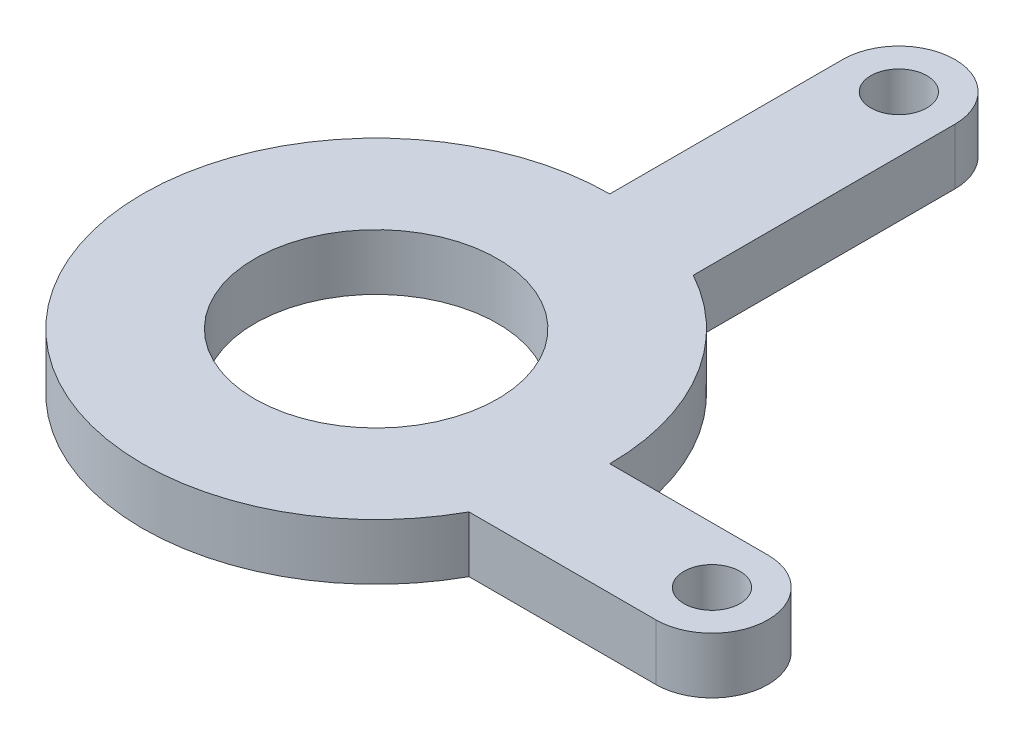
ISO-10303-21;
HEADER;
FILE_DESCRIPTION(('STEP AP214'),'2;1');
FILE_NAME('part.step','',(''),(''),'','','');
FILE_SCHEMA(('AUTOMOTIVE_DESIGN { 1 0 10303 214 1 1 1 1 }'));
ENDSEC;
DATA;
#1=APPLICATION_CONTEXT('core data for automotive mechanical design processes');
#2=APPLICATION_PROTOCOL_DEFINITION('international standard','automotive_design',2000,#1);
#3=PRODUCT_CONTEXT('',#1,'mechanical');
#4=PRODUCT('Part','Part','',(#3));
#5=PRODUCT_RELATED_PRODUCT_CATEGORY('part','',(#4));
#6=PRODUCT_DEFINITION_FORMATION('','',#4);
#7=PRODUCT_DEFINITION_CONTEXT('part definition',#1,'design');
#8=PRODUCT_DEFINITION('design','',#6,#7);
#9=PRODUCT_DEFINITION_SHAPE('','',#8);
#10=(LENGTH_UNIT() NAMED_UNIT(*) SI_UNIT(.MILLI.,.METRE.));
#11=(NAMED_UNIT(*) PLANE_ANGLE_UNIT() SI_UNIT($,.RADIAN.));
#12=(NAMED_UNIT(*) SI_UNIT($,.STERADIAN.) SOLID_ANGLE_UNIT());
#13=UNCERTAINTY_MEASURE_WITH_UNIT(LENGTH_MEASURE(1.E-05),#10,'distance_accuracy_value','');
#14=(GEOMETRIC_REPRESENTATION_CONTEXT(3) GLOBAL_UNCERTAINTY_ASSIGNED_CONTEXT((#13)) GLOBAL_UNIT_ASSIGNED_CONTEXT((#10,
#11,#12)) REPRESENTATION_CONTEXT('',''));
#15=CARTESIAN_POINT('',(0.,0.,0.));
#16=DIRECTION('',(0.,0.,1.));
#17=DIRECTION('',(1.,0.,0.));
#18=AXIS2_PLACEMENT_3D('',#15,#16,#17);
#19=CARTESIAN_POINT('',(3.,3.,-24.9658560997307));
#20=DIRECTION('',(0.,1.,0.));
#21=DIRECTION('',(0.,0.,1.));
#22=AXIS2_PLACEMENT_3D('',#19,#20,#21);
#23=PLANE('',#22);
#24=CARTESIAN_POINT('',(20.9658560997307,3.,3.));
#25=DIRECTION('',(0.,1.,0.));
#26=DIRECTION('',(0.,0.,1.));
#27=AXIS2_PLACEMENT_3D('',#24,#25,#26);
#28=CIRCLE('',#27,1.5);
#29=CARTESIAN_POINT('',(20.9658560997307,3.,4.5));
#30=VERTEX_POINT('',#29);
#31=EDGE_CURVE('E268',#30,#30,#28,.T.);
#32=ORIENTED_EDGE('',*,*,#31,.F.);
#33=EDGE_LOOP('',(#32));
#34=FACE_BOUND('',#33,.T.);
#35=DIRECTION('',(0.,0.,-1.));
#36=VECTOR('',#35,1.);
#37=CARTESIAN_POINT('',(0.,3.,-12.5));
#38=LINE('',#37,#36);
#39=CARTESIAN_POINT('',(0.,3.,-12.5));
#40=VERTEX_POINT('',#39);
#41=CARTESIAN_POINT('',(0.,3.,-24.9658560997307));
#42=VERTEX_POINT('',#41);
#43=EDGE_CURVE('E231',#40,#42,#38,.T.);
#44=ORIENTED_EDGE('',*,*,#43,.F.);
#45=CARTESIAN_POINT('',(0.,3.,0.));
#46=DIRECTION('',(0.,1.,0.));
#47=DIRECTION('',(0.,0.,1.));
#48=AXIS2_PLACEMENT_3D('',#45,#46,#47);
#49=CIRCLE('',#48,12.5);
#50=CARTESIAN_POINT('',(10.9658560997307,3.,6.));
#51=VERTEX_POINT('',#50);
#52=EDGE_CURVE('E192',#40,#51,#49,.T.);
#53=ORIENTED_EDGE('',*,*,#52,.T.);
#54=DIRECTION('',(1.,0.,0.));
#55=VECTOR('',#54,1.);
#56=CARTESIAN_POINT('',(10.9658560997307,3.,6.));
#57=LINE('',#56,#55);
#58=CARTESIAN_POINT('',(20.9658560997307,3.,6.));
#59=VERTEX_POINT('',#58);
#60=EDGE_CURVE('E185',#51,#59,#57,.T.);
#61=ORIENTED_EDGE('',*,*,#60,.T.);
#62=CARTESIAN_POINT('',(20.9658560997307,3.,3.));
#63=DIRECTION('',(0.,1.,0.));
#64=DIRECTION('',(0.,0.,1.));
#65=AXIS2_PLACEMENT_3D('',#62,#63,#64);
#66=CIRCLE('',#65,3.);
#67=CARTESIAN_POINT('',(20.9658560997307,3.,0.));
#68=VERTEX_POINT('',#67);
#69=EDGE_CURVE('E190',#59,#68,#66,.T.);
#70=ORIENTED_EDGE('',*,*,#69,.T.);
#71=DIRECTION('',(1.,0.,0.));
#72=VECTOR('',#71,1.);
#73=CARTESIAN_POINT('',(12.5,3.,0.));
#74=LINE('',#73,#72);
#75=CARTESIAN_POINT('',(12.5,3.,0.));
#76=VERTEX_POINT('',#75);
#77=EDGE_CURVE('E207',#76,#68,#74,.T.);
#78=ORIENTED_EDGE('',*,*,#77,.F.);
#79=CARTESIAN_POINT('',(0.,3.,0.));
#80=DIRECTION('',(0.,1.,0.));
#81=DIRECTION('',(0.,0.,1.));
#82=AXIS2_PLACEMENT_3D('',#79,#80,#81);
#83=CIRCLE('',#82,12.5);
#84=CARTESIAN_POINT('',(6.,3.,-10.9658560997307));
#85=VERTEX_POINT('',#84);
#86=EDGE_CURVE('E209',#76,#85,#83,.T.);
#87=ORIENTED_EDGE('',*,*,#86,.T.);
#88=DIRECTION('',(0.,0.,-1.));
#89=VECTOR('',#88,1.);
#90=CARTESIAN_POINT('',(6.,3.,-10.9658560997307));
#91=LINE('',#90,#89);
#92=CARTESIAN_POINT('',(6.,3.,-24.9658560997307));
#93=VERTEX_POINT('',#92);
#94=EDGE_CURVE('E256',#85,#93,#91,.T.);
#95=ORIENTED_EDGE('',*,*,#94,.T.);
#96=CARTESIAN_POINT('',(3.,3.,-24.9658560997307));
#97=DIRECTION('',(0.,1.,0.));
#98=DIRECTION('',(0.,0.,1.));
#99=AXIS2_PLACEMENT_3D('',#96,#97,#98);
#100=CIRCLE('',#99,3.);
#101=EDGE_CURVE('E171',#93,#42,#100,.T.);
#102=ORIENTED_EDGE('',*,*,#101,.T.);
#103=EDGE_LOOP('',(#44,#53,#61,#70,#78,#87,#95,#102));
#104=FACE_BOUND('',#103,.T.);
#105=CARTESIAN_POINT('',(0.,3.,0.));
#106=DIRECTION('',(0.,1.,0.));
#107=DIRECTION('',(0.,0.,1.));
#108=AXIS2_PLACEMENT_3D('',#105,#106,#107);
#109=CIRCLE('',#108,6.5);
#110=CARTESIAN_POINT('',(0.,3.,6.5));
#111=VERTEX_POINT('',#110);
#112=EDGE_CURVE('E218',#111,#111,#109,.T.);
#113=ORIENTED_EDGE('',*,*,#112,.F.);
#114=EDGE_LOOP('',(#113));
#115=FACE_BOUND('',#114,.T.);
#116=CARTESIAN_POINT('',(3.,3.,-24.9658560997307));
#117=DIRECTION('',(0.,1.,0.));
#118=DIRECTION('',(0.,0.,1.));
#119=AXIS2_PLACEMENT_3D('',#116,#117,#118);
#120=CIRCLE('',#119,1.5);
#121=CARTESIAN_POINT('',(3.,3.,-23.4658560997307));
#122=VERTEX_POINT('',#121);
#123=EDGE_CURVE('E274',#122,#122,#120,.T.);
#124=ORIENTED_EDGE('',*,*,#123,.F.);
#125=EDGE_LOOP('',(#124));
#126=FACE_BOUND('',#125,.T.);
#127=ADVANCED_FACE('F115',(#34,#104,#115,#126),#23,.T.);
#128=CARTESIAN_POINT('',(3.,0.,-24.9658560997307));
#129=DIRECTION('',(0.,1.,0.));
#130=DIRECTION('',(0.,0.,1.));
#131=AXIS2_PLACEMENT_3D('',#128,#129,#130);
#132=PLANE('',#131);
#133=DIRECTION('',(0.,0.,-1.));
#134=VECTOR('',#133,1.);
#135=CARTESIAN_POINT('',(0.,0.,-12.5));
#136=LINE('',#135,#134);
#137=CARTESIAN_POINT('',(0.,0.,-12.5));
#138=VERTEX_POINT('',#137);
#139=CARTESIAN_POINT('',(0.,0.,-24.9658560997307));
#140=VERTEX_POINT('',#139);
#141=EDGE_CURVE('E214',#138,#140,#136,.T.);
#142=ORIENTED_EDGE('',*,*,#141,.T.);
#143=CARTESIAN_POINT('',(3.,0.,-24.9658560997307));
#144=DIRECTION('',(0.,1.,0.));
#145=DIRECTION('',(0.,0.,1.));
#146=AXIS2_PLACEMENT_3D('',#143,#144,#145);
#147=CIRCLE('',#146,3.);
#148=CARTESIAN_POINT('',(6.,0.,-24.9658560997307));
#149=VERTEX_POINT('',#148);
#150=EDGE_CURVE('E217',#149,#140,#147,.T.);
#151=ORIENTED_EDGE('',*,*,#150,.F.);
#152=DIRECTION('',(0.,0.,-1.));
#153=VECTOR('',#152,1.);
#154=CARTESIAN_POINT('',(6.,0.,-10.9658560997307));
#155=LINE('',#154,#153);
#156=CARTESIAN_POINT('',(6.,0.,-10.9658560997307));
#157=VERTEX_POINT('',#156);
#158=EDGE_CURVE('E221',#157,#149,#155,.T.);
#159=ORIENTED_EDGE('',*,*,#158,.F.);
#160=CARTESIAN_POINT('',(0.,0.,0.));
#161=DIRECTION('',(0.,1.,0.));
#162=DIRECTION('',(0.,0.,1.));
#163=AXIS2_PLACEMENT_3D('',#160,#161,#162);
#164=CIRCLE('',#163,12.5);
#165=CARTESIAN_POINT('',(12.5,0.,0.));
#166=VERTEX_POINT('',#165);
#167=EDGE_CURVE('E223',#166,#157,#164,.T.);
#168=ORIENTED_EDGE('',*,*,#167,.F.);
#169=DIRECTION('',(1.,0.,0.));
#170=VECTOR('',#169,1.);
#171=CARTESIAN_POINT('',(12.5,0.,0.));
#172=LINE('',#171,#170);
#173=CARTESIAN_POINT('',(20.9658560997307,0.,0.));
#174=VERTEX_POINT('',#173);
#175=EDGE_CURVE('E225',#166,#174,#172,.T.);
#176=ORIENTED_EDGE('',*,*,#175,.T.);
#177=CARTESIAN_POINT('',(20.9658560997307,0.,3.));
#178=DIRECTION('',(0.,1.,0.));
#179=DIRECTION('',(0.,0.,1.));
#180=AXIS2_PLACEMENT_3D('',#177,#178,#179);
#181=CIRCLE('',#180,3.);
#182=CARTESIAN_POINT('',(20.9658560997307,0.,6.));
#183=VERTEX_POINT('',#182);
#184=EDGE_CURVE('E228',#183,#174,#181,.T.);
#185=ORIENTED_EDGE('',*,*,#184,.F.);
#186=DIRECTION('',(1.,0.,0.));
#187=VECTOR('',#186,1.);
#188=CARTESIAN_POINT('',(10.9658560997307,0.,6.));
#189=LINE('',#188,#187);
#190=CARTESIAN_POINT('',(10.9658560997307,0.,6.));
#191=VERTEX_POINT('',#190);
#192=EDGE_CURVE('E199',#191,#183,#189,.T.);
#193=ORIENTED_EDGE('',*,*,#192,.F.);
#194=CARTESIAN_POINT('',(0.,0.,0.));
#195=DIRECTION('',(0.,1.,0.));
#196=DIRECTION('',(0.,0.,1.));
#197=AXIS2_PLACEMENT_3D('',#194,#195,#196);
#198=CIRCLE('',#197,12.5);
#199=EDGE_CURVE('E161',#138,#191,#198,.T.);
#200=ORIENTED_EDGE('',*,*,#199,.F.);
#201=EDGE_LOOP('',(#142,#151,#159,#168,#176,#185,#193,#200));
#202=FACE_BOUND('',#201,.T.);
#203=CARTESIAN_POINT('',(0.,0.,0.));
#204=DIRECTION('',(0.,1.,0.));
#205=DIRECTION('',(0.,0.,1.));
#206=AXIS2_PLACEMENT_3D('',#203,#204,#205);
#207=CIRCLE('',#206,6.5);
#208=CARTESIAN_POINT('',(0.,0.,6.5));
#209=VERTEX_POINT('',#208);
#210=EDGE_CURVE('E265',#209,#209,#207,.T.);
#211=ORIENTED_EDGE('',*,*,#210,.T.);
#212=EDGE_LOOP('',(#211));
#213=FACE_BOUND('',#212,.T.);
#214=CARTESIAN_POINT('',(20.9658560997307,0.,3.));
#215=DIRECTION('',(0.,1.,0.));
#216=DIRECTION('',(0.,0.,1.));
#217=AXIS2_PLACEMENT_3D('',#214,#215,#216);
#218=CIRCLE('',#217,1.5);
#219=CARTESIAN_POINT('',(20.9658560997307,0.,4.5));
#220=VERTEX_POINT('',#219);
#221=EDGE_CURVE('E271',#220,#220,#218,.T.);
#222=ORIENTED_EDGE('',*,*,#221,.T.);
#223=EDGE_LOOP('',(#222));
#224=FACE_BOUND('',#223,.T.);
#225=CARTESIAN_POINT('',(3.,0.,-24.9658560997307));
#226=DIRECTION('',(0.,1.,0.));
#227=DIRECTION('',(0.,0.,1.));
#228=AXIS2_PLACEMENT_3D('',#225,#226,#227);
#229=CIRCLE('',#228,1.5);
#230=CARTESIAN_POINT('',(3.,0.,-23.4658560997307));
#231=VERTEX_POINT('',#230);
#232=EDGE_CURVE('E277',#231,#231,#229,.T.);
#233=ORIENTED_EDGE('',*,*,#232,.T.);
#234=EDGE_LOOP('',(#233));
#235=FACE_BOUND('',#234,.T.);
#236=ADVANCED_FACE('F247',(#202,#213,#224,#235),#132,.F.);
#237=CARTESIAN_POINT('',(0.,3.,-12.5));
#238=DIRECTION('',(-1.,0.,0.));
#239=DIRECTION('',(0.,0.,1.));
#240=AXIS2_PLACEMENT_3D('',#237,#238,#239);
#241=PLANE('',#240);
#242=ORIENTED_EDGE('',*,*,#141,.F.);
#243=DIRECTION('',(0.,-1.,0.));
#244=VECTOR('',#243,1.);
#245=CARTESIAN_POINT('',(0.,3.,-12.5));
#246=LINE('',#245,#244);
#247=EDGE_CURVE('E12',#40,#138,#246,.T.);
#248=ORIENTED_EDGE('',*,*,#247,.F.);
#249=ORIENTED_EDGE('',*,*,#43,.T.);
#250=DIRECTION('',(0.,-1.,0.));
#251=VECTOR('',#250,1.);
#252=CARTESIAN_POINT('',(0.,3.,-24.9658560997307));
#253=LINE('',#252,#251);
#254=EDGE_CURVE('E119',#42,#140,#253,.T.);
#255=ORIENTED_EDGE('',*,*,#254,.T.);
#256=EDGE_LOOP('',(#242,#248,#249,#255));
#257=FACE_BOUND('',#256,.T.);
#258=ADVANCED_FACE('F117',(#257),#241,.T.);
#259=CARTESIAN_POINT('',(0.,3.,0.));
#260=DIRECTION('',(0.,-1.,0.));
#261=DIRECTION('',(0.,0.,-1.));
#262=AXIS2_PLACEMENT_3D('',#259,#260,#261);
#263=CYLINDRICAL_SURFACE('',#262,12.5);
#264=ORIENTED_EDGE('',*,*,#199,.T.);
#265=DIRECTION('',(0.,-1.,0.));
#266=VECTOR('',#265,1.);
#267=CARTESIAN_POINT('',(10.9658560997307,3.,6.));
#268=LINE('',#267,#266);
#269=EDGE_CURVE('E125',#51,#191,#268,.T.);
#270=ORIENTED_EDGE('',*,*,#269,.F.);
#271=ORIENTED_EDGE('',*,*,#52,.F.);
#272=ORIENTED_EDGE('',*,*,#247,.T.);
#273=EDGE_LOOP('',(#264,#270,#271,#272));
#274=FACE_BOUND('',#273,.T.);
#275=ADVANCED_FACE('F298',(#274),#263,.T.);
#276=CARTESIAN_POINT('',(10.9658560997307,3.,6.));
#277=DIRECTION('',(0.,0.,-1.));
#278=DIRECTION('',(-1.,0.,0.));
#279=AXIS2_PLACEMENT_3D('',#276,#277,#278);
#280=PLANE('',#279);
#281=ORIENTED_EDGE('',*,*,#192,.T.);
#282=DIRECTION('',(0.,-1.,0.));
#283=VECTOR('',#282,1.);
#284=CARTESIAN_POINT('',(20.9658560997307,3.,6.));
#285=LINE('',#284,#283);
#286=EDGE_CURVE('E196',#59,#183,#285,.T.);
#287=ORIENTED_EDGE('',*,*,#286,.F.);
#288=ORIENTED_EDGE('',*,*,#60,.F.);
#289=ORIENTED_EDGE('',*,*,#269,.T.);
#290=EDGE_LOOP('',(#281,#287,#288,#289));
#291=FACE_BOUND('',#290,.T.);
#292=ADVANCED_FACE('F197',(#291),#280,.F.);
#293=CARTESIAN_POINT('',(20.9658560997307,3.,3.));
#294=DIRECTION('',(0.,-1.,0.));
#295=DIRECTION('',(0.,0.,-1.));
#296=AXIS2_PLACEMENT_3D('',#293,#294,#295);
#297=CYLINDRICAL_SURFACE('',#296,3.);
#298=ORIENTED_EDGE('',*,*,#184,.T.);
#299=DIRECTION('',(0.,-1.,0.));
#300=VECTOR('',#299,1.);
#301=CARTESIAN_POINT('',(20.9658560997307,3.,0.));
#302=LINE('',#301,#300);
#303=EDGE_CURVE('E203',#68,#174,#302,.T.);
#304=ORIENTED_EDGE('',*,*,#303,.F.);
#305=ORIENTED_EDGE('',*,*,#69,.F.);
#306=ORIENTED_EDGE('',*,*,#286,.T.);
#307=EDGE_LOOP('',(#298,#304,#305,#306));
#308=FACE_BOUND('',#307,.T.);
#309=ADVANCED_FACE('F205',(#308),#297,.T.);
#310=CARTESIAN_POINT('',(12.5,3.,0.));
#311=DIRECTION('',(0.,0.,-1.));
#312=DIRECTION('',(-1.,0.,0.));
#313=AXIS2_PLACEMENT_3D('',#310,#311,#312);
#314=PLANE('',#313);
#315=ORIENTED_EDGE('',*,*,#175,.F.);
#316=DIRECTION('',(0.,-1.,0.));
#317=VECTOR('',#316,1.);
#318=CARTESIAN_POINT('',(12.5,3.,0.));
#319=LINE('',#318,#317);
#320=EDGE_CURVE('E235',#76,#166,#319,.T.);
#321=ORIENTED_EDGE('',*,*,#320,.F.);
#322=ORIENTED_EDGE('',*,*,#77,.T.);
#323=ORIENTED_EDGE('',*,*,#303,.T.);
#324=EDGE_LOOP('',(#315,#321,#322,#323));
#325=FACE_BOUND('',#324,.T.);
#326=ADVANCED_FACE('F252',(#325),#314,.T.);
#327=CARTESIAN_POINT('',(0.,3.,0.));
#328=DIRECTION('',(0.,-1.,0.));
#329=DIRECTION('',(0.,0.,-1.));
#330=AXIS2_PLACEMENT_3D('',#327,#328,#329);
#331=CYLINDRICAL_SURFACE('',#330,12.5);
#332=ORIENTED_EDGE('',*,*,#167,.T.);
#333=DIRECTION('',(0.,-1.,0.));
#334=VECTOR('',#333,1.);
#335=CARTESIAN_POINT('',(6.,3.,-10.9658560997307));
#336=LINE('',#335,#334);
#337=EDGE_CURVE('E237',#85,#157,#336,.T.);
#338=ORIENTED_EDGE('',*,*,#337,.F.);
#339=ORIENTED_EDGE('',*,*,#86,.F.);
#340=ORIENTED_EDGE('',*,*,#320,.T.);
#341=EDGE_LOOP('',(#332,#338,#339,#340));
#342=FACE_BOUND('',#341,.T.);
#343=ADVANCED_FACE('F258',(#342),#331,.T.);
#344=CARTESIAN_POINT('',(6.,3.,-10.9658560997307));
#345=DIRECTION('',(-1.,0.,0.));
#346=DIRECTION('',(0.,0.,1.));
#347=AXIS2_PLACEMENT_3D('',#344,#345,#346);
#348=PLANE('',#347);
#349=ORIENTED_EDGE('',*,*,#158,.T.);
#350=DIRECTION('',(0.,-1.,0.));
#351=VECTOR('',#350,1.);
#352=CARTESIAN_POINT('',(6.,3.,-24.9658560997307));
#353=LINE('',#352,#351);
#354=EDGE_CURVE('E239',#93,#149,#353,.T.);
#355=ORIENTED_EDGE('',*,*,#354,.F.);
#356=ORIENTED_EDGE('',*,*,#94,.F.);
#357=ORIENTED_EDGE('',*,*,#337,.T.);
#358=EDGE_LOOP('',(#349,#355,#356,#357));
#359=FACE_BOUND('',#358,.T.);
#360=ADVANCED_FACE('F260',(#359),#348,.F.);
#361=CARTESIAN_POINT('',(3.,3.,-24.9658560997307));
#362=DIRECTION('',(0.,-1.,0.));
#363=DIRECTION('',(0.,0.,-1.));
#364=AXIS2_PLACEMENT_3D('',#361,#362,#363);
#365=CYLINDRICAL_SURFACE('',#364,3.);
#366=ORIENTED_EDGE('',*,*,#150,.T.);
#367=ORIENTED_EDGE('',*,*,#254,.F.);
#368=ORIENTED_EDGE('',*,*,#101,.F.);
#369=ORIENTED_EDGE('',*,*,#354,.T.);
#370=EDGE_LOOP('',(#366,#367,#368,#369));
#371=FACE_BOUND('',#370,.T.);
#372=ADVANCED_FACE('F244',(#371),#365,.T.);
#373=CARTESIAN_POINT('',(0.,3.,0.));
#374=DIRECTION('',(0.,-1.,0.));
#375=DIRECTION('',(0.,0.,-1.));
#376=AXIS2_PLACEMENT_3D('',#373,#374,#375);
#377=CYLINDRICAL_SURFACE('',#376,6.5);
#378=ORIENTED_EDGE('',*,*,#112,.T.);
#379=EDGE_LOOP('',(#378));
#380=FACE_BOUND('',#379,.T.);
#381=ORIENTED_EDGE('',*,*,#210,.F.);
#382=EDGE_LOOP('',(#381));
#383=FACE_BOUND('',#382,.T.);
#384=ADVANCED_FACE('F295',(#380,#383),#377,.F.);
#385=CARTESIAN_POINT('',(20.9658560997307,3.,3.));
#386=DIRECTION('',(0.,-1.,0.));
#387=DIRECTION('',(0.,0.,-1.));
#388=AXIS2_PLACEMENT_3D('',#385,#386,#387);
#389=CYLINDRICAL_SURFACE('',#388,1.5);
#390=ORIENTED_EDGE('',*,*,#31,.T.);
#391=EDGE_LOOP('',(#390));
#392=FACE_BOUND('',#391,.T.);
#393=ORIENTED_EDGE('',*,*,#221,.F.);
#394=EDGE_LOOP('',(#393));
#395=FACE_BOUND('',#394,.T.);
#396=ADVANCED_FACE('F314',(#392,#395),#389,.F.);
#397=CARTESIAN_POINT('',(3.,3.,-24.9658560997307));
#398=DIRECTION('',(0.,-1.,0.));
#399=DIRECTION('',(0.,0.,-1.));
#400=AXIS2_PLACEMENT_3D('',#397,#398,#399);
#401=CYLINDRICAL_SURFACE('',#400,1.5);
#402=ORIENTED_EDGE('',*,*,#123,.T.);
#403=EDGE_LOOP('',(#402));
#404=FACE_BOUND('',#403,.T.);
#405=ORIENTED_EDGE('',*,*,#232,.F.);
#406=EDGE_LOOP('',(#405));
#407=FACE_BOUND('',#406,.T.);
#408=ADVANCED_FACE('F283',(#404,#407),#401,.F.);
#409=CLOSED_SHELL('',(#127,#236,#258,#275,#292,#309,#326,#343,#360,#372,#384,#396,#408));
#410=MANIFOLD_SOLID_BREP('B2',#409);
#411=ADVANCED_BREP_SHAPE_REPRESENTATION('',(#18,#410),#14);
#412=SHAPE_DEFINITION_REPRESENTATION(#9,#411);
ENDSEC;
END-ISO-10303-21;
